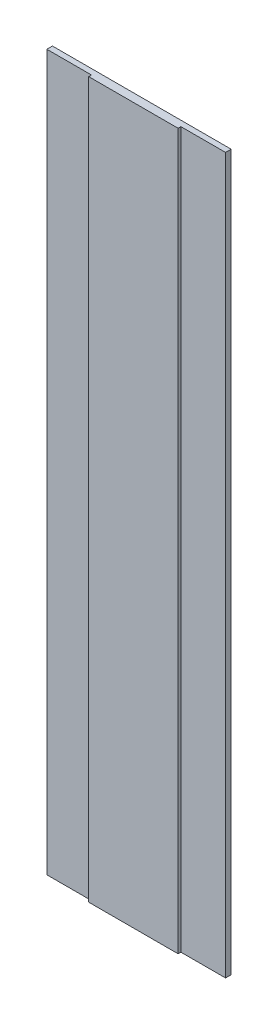
ISO-10303-21;
HEADER;
FILE_DESCRIPTION(('STEP AP214'),'2;1');
FILE_NAME('part.step','',(''),(''),'','','');
FILE_SCHEMA(('AUTOMOTIVE_DESIGN { 1 0 10303 214 1 1 1 1 }'));
ENDSEC;
DATA;
#1=APPLICATION_CONTEXT('core data for automotive mechanical design processes');
#2=APPLICATION_PROTOCOL_DEFINITION('international standard','automotive_design',2000,#1);
#3=PRODUCT_CONTEXT('',#1,'mechanical');
#4=PRODUCT('Part','Part','',(#3));
#5=PRODUCT_RELATED_PRODUCT_CATEGORY('part','',(#4));
#6=PRODUCT_DEFINITION_FORMATION('','',#4);
#7=PRODUCT_DEFINITION_CONTEXT('part definition',#1,'design');
#8=PRODUCT_DEFINITION('design','',#6,#7);
#9=PRODUCT_DEFINITION_SHAPE('','',#8);
#10=(LENGTH_UNIT() NAMED_UNIT(*) SI_UNIT(.MILLI.,.METRE.));
#11=(NAMED_UNIT(*) PLANE_ANGLE_UNIT() SI_UNIT($,.RADIAN.));
#12=(NAMED_UNIT(*) SI_UNIT($,.STERADIAN.) SOLID_ANGLE_UNIT());
#13=UNCERTAINTY_MEASURE_WITH_UNIT(LENGTH_MEASURE(1.E-05),#10,'distance_accuracy_value','');
#14=(GEOMETRIC_REPRESENTATION_CONTEXT(3) GLOBAL_UNCERTAINTY_ASSIGNED_CONTEXT((#13)) GLOBAL_UNIT_ASSIGNED_CONTEXT((#10,
#11,#12)) REPRESENTATION_CONTEXT('',''));
#15=CARTESIAN_POINT('',(0.,0.,0.));
#16=DIRECTION('',(0.,0.,1.));
#17=DIRECTION('',(1.,0.,0.));
#18=AXIS2_PLACEMENT_3D('',#15,#16,#17);
#19=CARTESIAN_POINT('',(50.8,0.,0.));
#20=DIRECTION('',(-1.,0.,0.));
#21=DIRECTION('',(0.,0.,1.));
#22=AXIS2_PLACEMENT_3D('',#19,#20,#21);
#23=PLANE('',#22);
#24=DIRECTION('',(0.,1.,0.));
#25=VECTOR('',#24,1.);
#26=CARTESIAN_POINT('',(50.8,495.3,6.35));
#27=LINE('',#26,#25);
#28=CARTESIAN_POINT('',(50.8,177.8,6.35));
#29=VERTEX_POINT('',#28);
#30=CARTESIAN_POINT('',(50.8,990.6,6.35));
#31=VERTEX_POINT('',#30);
#32=EDGE_CURVE('E93',#29,#31,#27,.T.);
#33=ORIENTED_EDGE('',*,*,#32,.F.);
#34=DIRECTION('',(0.,0.,-1.));
#35=VECTOR('',#34,1.);
#36=CARTESIAN_POINT('',(50.8,177.8,0.));
#37=LINE('',#36,#35);
#38=CARTESIAN_POINT('',(50.8,177.8,9.525));
#39=VERTEX_POINT('',#38);
#40=EDGE_CURVE('E106',#39,#29,#37,.T.);
#41=ORIENTED_EDGE('',*,*,#40,.F.);
#42=DIRECTION('',(0.,1.,0.));
#43=VECTOR('',#42,1.);
#44=CARTESIAN_POINT('',(50.8,495.3,9.525));
#45=LINE('',#44,#43);
#46=CARTESIAN_POINT('',(50.8,990.6,9.525));
#47=VERTEX_POINT('',#46);
#48=EDGE_CURVE('E20',#47,#39,#45,.F.);
#49=ORIENTED_EDGE('',*,*,#48,.F.);
#50=DIRECTION('',(0.,0.,1.));
#51=VECTOR('',#50,1.);
#52=CARTESIAN_POINT('',(50.8,990.6,0.));
#53=LINE('',#52,#51);
#54=EDGE_CURVE('E129',#31,#47,#53,.T.);
#55=ORIENTED_EDGE('',*,*,#54,.F.);
#56=EDGE_LOOP('',(#33,#41,#49,#55));
#57=FACE_BOUND('',#56,.T.);
#58=ADVANCED_FACE('F17',(#57),#23,.T.);
#59=CARTESIAN_POINT('',(101.6,495.3,9.525));
#60=DIRECTION('',(0.,0.,1.));
#61=DIRECTION('',(1.,0.,0.));
#62=AXIS2_PLACEMENT_3D('',#59,#60,#61);
#63=PLANE('',#62);
#64=DIRECTION('',(1.,0.,0.));
#65=VECTOR('',#64,1.);
#66=CARTESIAN_POINT('',(152.4,177.8,9.525));
#67=LINE('',#66,#65);
#68=CARTESIAN_POINT('',(152.4,177.8,9.525));
#69=VERTEX_POINT('',#68);
#70=EDGE_CURVE('E104',#69,#39,#67,.F.);
#71=ORIENTED_EDGE('',*,*,#70,.F.);
#72=DIRECTION('',(0.,1.,0.));
#73=VECTOR('',#72,1.);
#74=CARTESIAN_POINT('',(152.4,990.6,9.525));
#75=LINE('',#74,#73);
#76=CARTESIAN_POINT('',(152.4,990.6,9.525));
#77=VERTEX_POINT('',#76);
#78=EDGE_CURVE('E79',#77,#69,#75,.F.);
#79=ORIENTED_EDGE('',*,*,#78,.F.);
#80=DIRECTION('',(1.,0.,0.));
#81=VECTOR('',#80,1.);
#82=CARTESIAN_POINT('',(50.8,990.6,9.525));
#83=LINE('',#82,#81);
#84=EDGE_CURVE('E114',#47,#77,#83,.T.);
#85=ORIENTED_EDGE('',*,*,#84,.F.);
#86=ORIENTED_EDGE('',*,*,#48,.T.);
#87=EDGE_LOOP('',(#71,#79,#85,#86));
#88=FACE_BOUND('',#87,.T.);
#89=ADVANCED_FACE('F113',(#88),#63,.T.);
#90=CARTESIAN_POINT('',(152.4,990.6,0.));
#91=DIRECTION('',(1.,0.,0.));
#92=DIRECTION('',(0.,0.,-1.));
#93=AXIS2_PLACEMENT_3D('',#90,#91,#92);
#94=PLANE('',#93);
#95=DIRECTION('',(0.,1.,0.));
#96=VECTOR('',#95,1.);
#97=CARTESIAN_POINT('',(152.4,495.3,6.35));
#98=LINE('',#97,#96);
#99=CARTESIAN_POINT('',(152.4,990.6,6.35));
#100=VERTEX_POINT('',#99);
#101=CARTESIAN_POINT('',(152.4,177.8,6.35));
#102=VERTEX_POINT('',#101);
#103=EDGE_CURVE('E86',#100,#102,#98,.F.);
#104=ORIENTED_EDGE('',*,*,#103,.F.);
#105=DIRECTION('',(0.,0.,1.));
#106=VECTOR('',#105,1.);
#107=CARTESIAN_POINT('',(152.4,990.6,0.));
#108=LINE('',#107,#106);
#109=EDGE_CURVE('E132',#77,#100,#108,.F.);
#110=ORIENTED_EDGE('',*,*,#109,.F.);
#111=ORIENTED_EDGE('',*,*,#78,.T.);
#112=DIRECTION('',(0.,0.,-1.));
#113=VECTOR('',#112,1.);
#114=CARTESIAN_POINT('',(152.4,177.8,0.));
#115=LINE('',#114,#113);
#116=EDGE_CURVE('E99',#102,#69,#115,.F.);
#117=ORIENTED_EDGE('',*,*,#116,.F.);
#118=EDGE_LOOP('',(#104,#110,#111,#117));
#119=FACE_BOUND('',#118,.T.);
#120=ADVANCED_FACE('F103',(#119),#94,.T.);
#121=CARTESIAN_POINT('',(127.,495.3,6.35));
#122=DIRECTION('',(0.,0.,1.));
#123=DIRECTION('',(1.,0.,0.));
#124=AXIS2_PLACEMENT_3D('',#121,#122,#123);
#125=PLANE('',#124);
#126=ORIENTED_EDGE('',*,*,#103,.T.);
#127=DIRECTION('',(1.,0.,0.));
#128=VECTOR('',#127,1.);
#129=CARTESIAN_POINT('',(152.4,177.8,6.35));
#130=LINE('',#129,#128);
#131=CARTESIAN_POINT('',(203.2,177.8,6.35));
#132=VERTEX_POINT('',#131);
#133=EDGE_CURVE('E90',#132,#102,#130,.F.);
#134=ORIENTED_EDGE('',*,*,#133,.F.);
#135=DIRECTION('',(0.,1.,0.));
#136=VECTOR('',#135,1.);
#137=CARTESIAN_POINT('',(203.2,990.6,6.35));
#138=LINE('',#137,#136);
#139=CARTESIAN_POINT('',(203.2,990.6,6.35));
#140=VERTEX_POINT('',#139);
#141=EDGE_CURVE('E121',#140,#132,#138,.F.);
#142=ORIENTED_EDGE('',*,*,#141,.F.);
#143=DIRECTION('',(1.,0.,0.));
#144=VECTOR('',#143,1.);
#145=CARTESIAN_POINT('',(50.8,990.6,6.35));
#146=LINE('',#145,#144);
#147=EDGE_CURVE('E92',#100,#140,#146,.T.);
#148=ORIENTED_EDGE('',*,*,#147,.F.);
#149=EDGE_LOOP('',(#126,#134,#142,#148));
#150=FACE_BOUND('',#149,.T.);
#151=ADVANCED_FACE('F88',(#150),#125,.T.);
#152=CARTESIAN_POINT('',(76.2,495.3,6.35));
#153=DIRECTION('',(0.,0.,1.));
#154=DIRECTION('',(1.,0.,0.));
#155=AXIS2_PLACEMENT_3D('',#152,#153,#154);
#156=PLANE('',#155);
#157=ORIENTED_EDGE('',*,*,#32,.T.);
#158=DIRECTION('',(1.,0.,0.));
#159=VECTOR('',#158,1.);
#160=CARTESIAN_POINT('',(50.8,990.6,6.35));
#161=LINE('',#160,#159);
#162=CARTESIAN_POINT('',(0.,990.6,6.35));
#163=VERTEX_POINT('',#162);
#164=EDGE_CURVE('E126',#163,#31,#161,.T.);
#165=ORIENTED_EDGE('',*,*,#164,.F.);
#166=DIRECTION('',(0.,1.,0.));
#167=VECTOR('',#166,1.);
#168=CARTESIAN_POINT('',(0.,0.,6.35));
#169=LINE('',#168,#167);
#170=CARTESIAN_POINT('',(0.,177.8,6.35));
#171=VERTEX_POINT('',#170);
#172=EDGE_CURVE('E140',#171,#163,#169,.T.);
#173=ORIENTED_EDGE('',*,*,#172,.F.);
#174=DIRECTION('',(1.,0.,0.));
#175=VECTOR('',#174,1.);
#176=CARTESIAN_POINT('',(152.4,177.8,6.35));
#177=LINE('',#176,#175);
#178=EDGE_CURVE('E120',#29,#171,#177,.F.);
#179=ORIENTED_EDGE('',*,*,#178,.F.);
#180=EDGE_LOOP('',(#157,#165,#173,#179));
#181=FACE_BOUND('',#180,.T.);
#182=ADVANCED_FACE('F167',(#181),#156,.T.);
#183=CARTESIAN_POINT('',(152.4,177.8,0.));
#184=DIRECTION('',(0.,-1.,0.));
#185=DIRECTION('',(0.,0.,-1.));
#186=AXIS2_PLACEMENT_3D('',#183,#184,#185);
#187=PLANE('',#186);
#188=DIRECTION('',(1.,0.,0.));
#189=VECTOR('',#188,1.);
#190=CARTESIAN_POINT('',(101.6,177.8,0.));
#191=LINE('',#190,#189);
#192=CARTESIAN_POINT('',(0.,177.8,0.));
#193=VERTEX_POINT('',#192);
#194=CARTESIAN_POINT('',(203.2,177.8,0.));
#195=VERTEX_POINT('',#194);
#196=EDGE_CURVE('E143',#193,#195,#191,.T.);
#197=ORIENTED_EDGE('',*,*,#196,.T.);
#198=DIRECTION('',(0.,0.,-1.));
#199=VECTOR('',#198,1.);
#200=CARTESIAN_POINT('',(203.2,177.8,0.));
#201=LINE('',#200,#199);
#202=EDGE_CURVE('E101',#132,#195,#201,.T.);
#203=ORIENTED_EDGE('',*,*,#202,.F.);
#204=ORIENTED_EDGE('',*,*,#133,.T.);
#205=ORIENTED_EDGE('',*,*,#116,.T.);
#206=ORIENTED_EDGE('',*,*,#70,.T.);
#207=ORIENTED_EDGE('',*,*,#40,.T.);
#208=ORIENTED_EDGE('',*,*,#178,.T.);
#209=DIRECTION('',(0.,0.,1.));
#210=VECTOR('',#209,1.);
#211=CARTESIAN_POINT('',(0.,177.8,0.));
#212=LINE('',#211,#210);
#213=EDGE_CURVE('E137',#193,#171,#212,.T.);
#214=ORIENTED_EDGE('',*,*,#213,.F.);
#215=EDGE_LOOP('',(#197,#203,#204,#205,#206,#207,#208,#214));
#216=FACE_BOUND('',#215,.T.);
#217=ADVANCED_FACE('F97',(#216),#187,.T.);
#218=CARTESIAN_POINT('',(203.2,990.6,0.));
#219=DIRECTION('',(1.,0.,0.));
#220=DIRECTION('',(0.,0.,-1.));
#221=AXIS2_PLACEMENT_3D('',#218,#219,#220);
#222=PLANE('',#221);
#223=ORIENTED_EDGE('',*,*,#141,.T.);
#224=ORIENTED_EDGE('',*,*,#202,.T.);
#225=DIRECTION('',(0.,1.,0.));
#226=VECTOR('',#225,1.);
#227=CARTESIAN_POINT('',(203.2,495.3,0.));
#228=LINE('',#227,#226);
#229=CARTESIAN_POINT('',(203.2,990.6,0.));
#230=VERTEX_POINT('',#229);
#231=EDGE_CURVE('E145',#195,#230,#228,.T.);
#232=ORIENTED_EDGE('',*,*,#231,.T.);
#233=DIRECTION('',(0.,0.,1.));
#234=VECTOR('',#233,1.);
#235=CARTESIAN_POINT('',(203.2,990.6,0.));
#236=LINE('',#235,#234);
#237=EDGE_CURVE('E135',#140,#230,#236,.F.);
#238=ORIENTED_EDGE('',*,*,#237,.F.);
#239=EDGE_LOOP('',(#223,#224,#232,#238));
#240=FACE_BOUND('',#239,.T.);
#241=ADVANCED_FACE('F157',(#240),#222,.T.);
#242=CARTESIAN_POINT('',(50.8,990.6,0.));
#243=DIRECTION('',(0.,1.,0.));
#244=DIRECTION('',(0.,0.,1.));
#245=AXIS2_PLACEMENT_3D('',#242,#243,#244);
#246=PLANE('',#245);
#247=DIRECTION('',(1.,0.,0.));
#248=VECTOR('',#247,1.);
#249=CARTESIAN_POINT('',(101.6,990.6,0.));
#250=LINE('',#249,#248);
#251=CARTESIAN_POINT('',(0.,990.6,0.));
#252=VERTEX_POINT('',#251);
#253=EDGE_CURVE('E26',#230,#252,#250,.F.);
#254=ORIENTED_EDGE('',*,*,#253,.T.);
#255=DIRECTION('',(0.,0.,1.));
#256=VECTOR('',#255,1.);
#257=CARTESIAN_POINT('',(0.,990.6,0.));
#258=LINE('',#257,#256);
#259=EDGE_CURVE('E34',#163,#252,#258,.F.);
#260=ORIENTED_EDGE('',*,*,#259,.F.);
#261=ORIENTED_EDGE('',*,*,#164,.T.);
#262=ORIENTED_EDGE('',*,*,#54,.T.);
#263=ORIENTED_EDGE('',*,*,#84,.T.);
#264=ORIENTED_EDGE('',*,*,#109,.T.);
#265=ORIENTED_EDGE('',*,*,#147,.T.);
#266=ORIENTED_EDGE('',*,*,#237,.T.);
#267=EDGE_LOOP('',(#254,#260,#261,#262,#263,#264,#265,#266));
#268=FACE_BOUND('',#267,.T.);
#269=ADVANCED_FACE('F151',(#268),#246,.T.);
#270=CARTESIAN_POINT('',(0.,0.,0.));
#271=DIRECTION('',(-1.,0.,0.));
#272=DIRECTION('',(0.,0.,1.));
#273=AXIS2_PLACEMENT_3D('',#270,#271,#272);
#274=PLANE('',#273);
#275=ORIENTED_EDGE('',*,*,#172,.T.);
#276=ORIENTED_EDGE('',*,*,#259,.T.);
#277=DIRECTION('',(0.,1.,0.));
#278=VECTOR('',#277,1.);
#279=CARTESIAN_POINT('',(0.,495.3,0.));
#280=LINE('',#279,#278);
#281=EDGE_CURVE('E11',#252,#193,#280,.F.);
#282=ORIENTED_EDGE('',*,*,#281,.T.);
#283=ORIENTED_EDGE('',*,*,#213,.T.);
#284=EDGE_LOOP('',(#275,#276,#282,#283));
#285=FACE_BOUND('',#284,.T.);
#286=ADVANCED_FACE('F165',(#285),#274,.T.);
#287=CARTESIAN_POINT('',(101.6,495.3,0.));
#288=DIRECTION('',(0.,0.,1.));
#289=DIRECTION('',(1.,0.,0.));
#290=AXIS2_PLACEMENT_3D('',#287,#288,#289);
#291=PLANE('',#290);
#292=ORIENTED_EDGE('',*,*,#253,.F.);
#293=ORIENTED_EDGE('',*,*,#231,.F.);
#294=ORIENTED_EDGE('',*,*,#196,.F.);
#295=ORIENTED_EDGE('',*,*,#281,.F.);
#296=EDGE_LOOP('',(#292,#293,#294,#295));
#297=FACE_BOUND('',#296,.T.);
#298=ADVANCED_FACE('F155',(#297),#291,.F.);
#299=CLOSED_SHELL('',(#58,#89,#120,#151,#182,#217,#241,#269,#286,#298));
#300=MANIFOLD_SOLID_BREP('B1',#299);
#301=ADVANCED_BREP_SHAPE_REPRESENTATION('',(#18,#300),#14);
#302=SHAPE_DEFINITION_REPRESENTATION(#9,#301);
ENDSEC;
END-ISO-10303-21;
